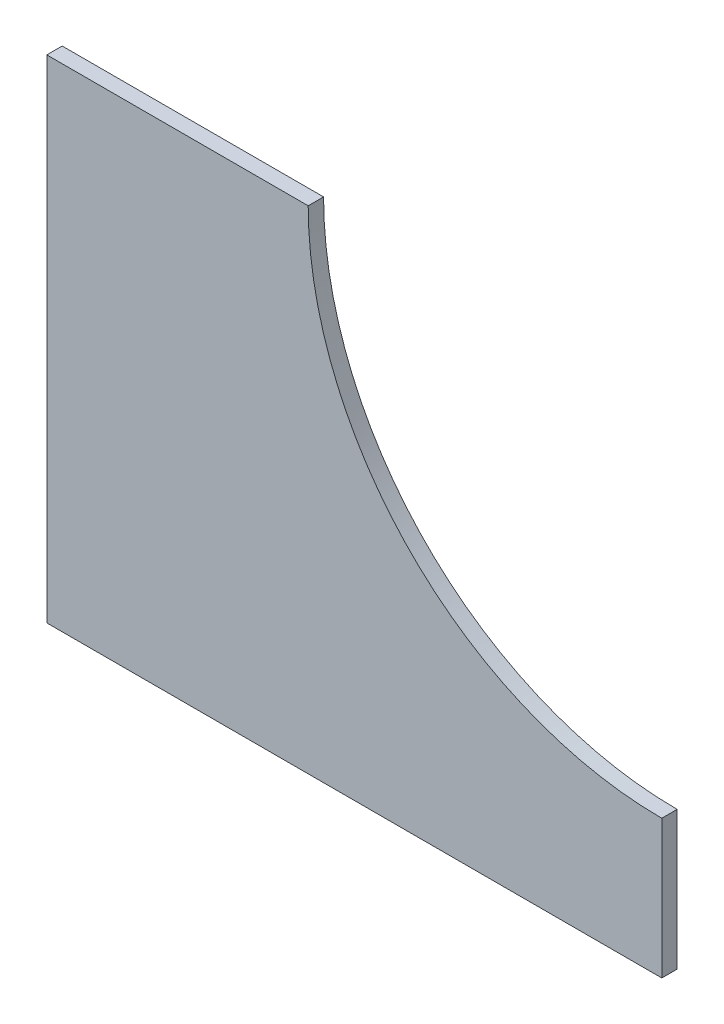
ISO-10303-21;
HEADER;
FILE_DESCRIPTION(('STEP AP214'),'2;1');
FILE_NAME('part.step','',(''),(''),'','','');
FILE_SCHEMA(('AUTOMOTIVE_DESIGN { 1 0 10303 214 1 1 1 1 }'));
ENDSEC;
DATA;
#1=APPLICATION_CONTEXT('core data for automotive mechanical design processes');
#2=APPLICATION_PROTOCOL_DEFINITION('international standard','automotive_design',2000,#1);
#3=PRODUCT_CONTEXT('',#1,'mechanical');
#4=PRODUCT('Part','Part','',(#3));
#5=PRODUCT_RELATED_PRODUCT_CATEGORY('part','',(#4));
#6=PRODUCT_DEFINITION_FORMATION('','',#4);
#7=PRODUCT_DEFINITION_CONTEXT('part definition',#1,'design');
#8=PRODUCT_DEFINITION('design','',#6,#7);
#9=PRODUCT_DEFINITION_SHAPE('','',#8);
#10=(LENGTH_UNIT() NAMED_UNIT(*) SI_UNIT(.MILLI.,.METRE.));
#11=(NAMED_UNIT(*) PLANE_ANGLE_UNIT() SI_UNIT($,.RADIAN.));
#12=(NAMED_UNIT(*) SI_UNIT($,.STERADIAN.) SOLID_ANGLE_UNIT());
#13=UNCERTAINTY_MEASURE_WITH_UNIT(LENGTH_MEASURE(1.E-05),#10,'distance_accuracy_value','');
#14=(GEOMETRIC_REPRESENTATION_CONTEXT(3) GLOBAL_UNCERTAINTY_ASSIGNED_CONTEXT((#13)) GLOBAL_UNIT_ASSIGNED_CONTEXT((#10,
#11,#12)) REPRESENTATION_CONTEXT('',''));
#15=CARTESIAN_POINT('',(0.,0.,0.));
#16=DIRECTION('',(0.,0.,1.));
#17=DIRECTION('',(1.,0.,0.));
#18=AXIS2_PLACEMENT_3D('',#15,#16,#17);
#19=CARTESIAN_POINT('',(98.4294784744164,-123.629958099048,3.175));
#20=DIRECTION('',(0.,0.,-1.));
#21=DIRECTION('',(-1.,0.,0.));
#22=AXIS2_PLACEMENT_3D('',#19,#20,#21);
#23=CYLINDRICAL_SURFACE('',#22,73.0250000000014);
#24=CARTESIAN_POINT('',(98.4294784744164,-123.629958099048,0.));
#25=DIRECTION('',(0.,0.,-1.));
#26=DIRECTION('',(-1.,0.,0.));
#27=AXIS2_PLACEMENT_3D('',#24,#25,#26);
#28=CIRCLE('',#27,73.0250000000014);
#29=CARTESIAN_POINT('',(98.4294784744164,-196.654958099049,0.));
#30=VERTEX_POINT('',#29);
#31=CARTESIAN_POINT('',(25.404478474415,-123.62995809905,0.));
#32=VERTEX_POINT('',#31);
#33=EDGE_CURVE('E109',#30,#32,#28,.T.);
#34=ORIENTED_EDGE('',*,*,#33,.T.);
#35=DIRECTION('',(0.,0.,-1.));
#36=VECTOR('',#35,1.);
#37=CARTESIAN_POINT('',(25.404478474415,-123.62995809905,3.175));
#38=LINE('',#37,#36);
#39=CARTESIAN_POINT('',(25.404478474415,-123.62995809905,3.175));
#40=VERTEX_POINT('',#39);
#41=EDGE_CURVE('E11',#40,#32,#38,.T.);
#42=ORIENTED_EDGE('',*,*,#41,.F.);
#43=CARTESIAN_POINT('',(98.4294784744164,-123.629958099048,3.175));
#44=DIRECTION('',(0.,0.,-1.));
#45=DIRECTION('',(-1.,0.,0.));
#46=AXIS2_PLACEMENT_3D('',#43,#44,#45);
#47=CIRCLE('',#46,73.0250000000014);
#48=CARTESIAN_POINT('',(98.4294784744164,-196.654958099049,3.175));
#49=VERTEX_POINT('',#48);
#50=EDGE_CURVE('E117',#49,#40,#47,.T.);
#51=ORIENTED_EDGE('',*,*,#50,.F.);
#52=DIRECTION('',(0.,0.,-1.));
#53=VECTOR('',#52,1.);
#54=CARTESIAN_POINT('',(98.4294784744164,-196.654958099049,3.175));
#55=LINE('',#54,#53);
#56=EDGE_CURVE('E105',#49,#30,#55,.T.);
#57=ORIENTED_EDGE('',*,*,#56,.T.);
#58=EDGE_LOOP('',(#34,#42,#51,#57));
#59=FACE_BOUND('',#58,.T.);
#60=ADVANCED_FACE('F35',(#59),#23,.F.);
#61=CARTESIAN_POINT('',(-28.570521525585,-123.62995809905,3.175));
#62=DIRECTION('',(0.,-1.,0.));
#63=DIRECTION('',(1.,0.,0.));
#64=AXIS2_PLACEMENT_3D('',#61,#62,#63);
#65=PLANE('',#64);
#66=DIRECTION('',(-1.,0.,0.));
#67=VECTOR('',#66,1.);
#68=CARTESIAN_POINT('',(-28.570521525585,-123.62995809905,0.));
#69=LINE('',#68,#67);
#70=CARTESIAN_POINT('',(-28.570521525585,-123.62995809905,0.));
#71=VERTEX_POINT('',#70);
#72=EDGE_CURVE('E112',#32,#71,#69,.T.);
#73=ORIENTED_EDGE('',*,*,#72,.T.);
#74=DIRECTION('',(0.,0.,-1.));
#75=VECTOR('',#74,1.);
#76=CARTESIAN_POINT('',(-28.570521525585,-123.62995809905,3.175));
#77=LINE('',#76,#75);
#78=CARTESIAN_POINT('',(-28.570521525585,-123.62995809905,3.175));
#79=VERTEX_POINT('',#78);
#80=EDGE_CURVE('E43',#79,#71,#77,.T.);
#81=ORIENTED_EDGE('',*,*,#80,.F.);
#82=DIRECTION('',(-1.,0.,0.));
#83=VECTOR('',#82,1.);
#84=CARTESIAN_POINT('',(-28.570521525585,-123.62995809905,3.175));
#85=LINE('',#84,#83);
#86=EDGE_CURVE('E85',#40,#79,#85,.T.);
#87=ORIENTED_EDGE('',*,*,#86,.F.);
#88=ORIENTED_EDGE('',*,*,#41,.T.);
#89=EDGE_LOOP('',(#73,#81,#87,#88));
#90=FACE_BOUND('',#89,.T.);
#91=ADVANCED_FACE('F136',(#90),#65,.F.);
#92=CARTESIAN_POINT('',(-28.570521525585,-225.22995809905,3.175));
#93=DIRECTION('',(1.,0.,0.));
#94=DIRECTION('',(0.,1.,0.));
#95=AXIS2_PLACEMENT_3D('',#92,#93,#94);
#96=PLANE('',#95);
#97=DIRECTION('',(0.,-1.,0.));
#98=VECTOR('',#97,1.);
#99=CARTESIAN_POINT('',(-28.570521525585,-225.22995809905,0.));
#100=LINE('',#99,#98);
#101=CARTESIAN_POINT('',(-28.570521525585,-225.22995809905,0.));
#102=VERTEX_POINT('',#101);
#103=EDGE_CURVE('E100',#71,#102,#100,.T.);
#104=ORIENTED_EDGE('',*,*,#103,.T.);
#105=DIRECTION('',(0.,0.,-1.));
#106=VECTOR('',#105,1.);
#107=CARTESIAN_POINT('',(-28.570521525585,-225.22995809905,3.175));
#108=LINE('',#107,#106);
#109=CARTESIAN_POINT('',(-28.570521525585,-225.22995809905,3.175));
#110=VERTEX_POINT('',#109);
#111=EDGE_CURVE('E97',#110,#102,#108,.T.);
#112=ORIENTED_EDGE('',*,*,#111,.F.);
#113=DIRECTION('',(0.,-1.,0.));
#114=VECTOR('',#113,1.);
#115=CARTESIAN_POINT('',(-28.570521525585,-225.22995809905,3.175));
#116=LINE('',#115,#114);
#117=EDGE_CURVE('E89',#79,#110,#116,.T.);
#118=ORIENTED_EDGE('',*,*,#117,.F.);
#119=ORIENTED_EDGE('',*,*,#80,.T.);
#120=EDGE_LOOP('',(#104,#112,#118,#119));
#121=FACE_BOUND('',#120,.T.);
#122=ADVANCED_FACE('F98',(#121),#96,.F.);
#123=CARTESIAN_POINT('',(98.4294784744164,-225.22995809905,3.175));
#124=DIRECTION('',(0.,1.,0.));
#125=DIRECTION('',(0.,0.,1.));
#126=AXIS2_PLACEMENT_3D('',#123,#124,#125);
#127=PLANE('',#126);
#128=DIRECTION('',(1.,0.,0.));
#129=VECTOR('',#128,1.);
#130=CARTESIAN_POINT('',(98.4294784744164,-225.22995809905,0.));
#131=LINE('',#130,#129);
#132=CARTESIAN_POINT('',(98.4294784744164,-225.22995809905,0.));
#133=VERTEX_POINT('',#132);
#134=EDGE_CURVE('E71',#102,#133,#131,.T.);
#135=ORIENTED_EDGE('',*,*,#134,.T.);
#136=DIRECTION('',(0.,0.,-1.));
#137=VECTOR('',#136,1.);
#138=CARTESIAN_POINT('',(98.4294784744164,-225.22995809905,3.175));
#139=LINE('',#138,#137);
#140=CARTESIAN_POINT('',(98.4294784744164,-225.22995809905,3.175));
#141=VERTEX_POINT('',#140);
#142=EDGE_CURVE('E101',#141,#133,#139,.T.);
#143=ORIENTED_EDGE('',*,*,#142,.F.);
#144=DIRECTION('',(1.,0.,0.));
#145=VECTOR('',#144,1.);
#146=CARTESIAN_POINT('',(98.4294784744164,-225.22995809905,3.175));
#147=LINE('',#146,#145);
#148=EDGE_CURVE('E93',#110,#141,#147,.T.);
#149=ORIENTED_EDGE('',*,*,#148,.F.);
#150=ORIENTED_EDGE('',*,*,#111,.T.);
#151=EDGE_LOOP('',(#135,#143,#149,#150));
#152=FACE_BOUND('',#151,.T.);
#153=ADVANCED_FACE('F103',(#152),#127,.F.);
#154=CARTESIAN_POINT('',(98.4294784744164,-196.654958099049,3.175));
#155=DIRECTION('',(-1.,0.,0.));
#156=DIRECTION('',(0.,0.,1.));
#157=AXIS2_PLACEMENT_3D('',#154,#155,#156);
#158=PLANE('',#157);
#159=DIRECTION('',(0.,1.,0.));
#160=VECTOR('',#159,1.);
#161=CARTESIAN_POINT('',(98.4294784744164,-196.654958099049,0.));
#162=LINE('',#161,#160);
#163=EDGE_CURVE('E77',#133,#30,#162,.T.);
#164=ORIENTED_EDGE('',*,*,#163,.T.);
#165=ORIENTED_EDGE('',*,*,#56,.F.);
#166=DIRECTION('',(0.,1.,0.));
#167=VECTOR('',#166,1.);
#168=CARTESIAN_POINT('',(98.4294784744164,-196.654958099049,3.175));
#169=LINE('',#168,#167);
#170=EDGE_CURVE('E51',#141,#49,#169,.T.);
#171=ORIENTED_EDGE('',*,*,#170,.F.);
#172=ORIENTED_EDGE('',*,*,#142,.T.);
#173=EDGE_LOOP('',(#164,#165,#171,#172));
#174=FACE_BOUND('',#173,.T.);
#175=ADVANCED_FACE('F125',(#174),#158,.F.);
#176=CARTESIAN_POINT('',(98.4294784744164,-123.629958099048,3.175));
#177=DIRECTION('',(0.,0.,-1.));
#178=DIRECTION('',(-1.,0.,0.));
#179=AXIS2_PLACEMENT_3D('',#176,#177,#178);
#180=PLANE('',#179);
#181=ORIENTED_EDGE('',*,*,#50,.T.);
#182=ORIENTED_EDGE('',*,*,#86,.T.);
#183=ORIENTED_EDGE('',*,*,#117,.T.);
#184=ORIENTED_EDGE('',*,*,#148,.T.);
#185=ORIENTED_EDGE('',*,*,#170,.T.);
#186=EDGE_LOOP('',(#181,#182,#183,#184,#185));
#187=FACE_BOUND('',#186,.T.);
#188=ADVANCED_FACE('F91',(#187),#180,.F.);
#189=CARTESIAN_POINT('',(98.4294784744164,-123.629958099048,0.));
#190=DIRECTION('',(0.,0.,-1.));
#191=DIRECTION('',(-1.,0.,0.));
#192=AXIS2_PLACEMENT_3D('',#189,#190,#191);
#193=PLANE('',#192);
#194=ORIENTED_EDGE('',*,*,#33,.F.);
#195=ORIENTED_EDGE('',*,*,#163,.F.);
#196=ORIENTED_EDGE('',*,*,#134,.F.);
#197=ORIENTED_EDGE('',*,*,#103,.F.);
#198=ORIENTED_EDGE('',*,*,#72,.F.);
#199=EDGE_LOOP('',(#194,#195,#196,#197,#198));
#200=FACE_BOUND('',#199,.T.);
#201=ADVANCED_FACE('F121',(#200),#193,.T.);
#202=CLOSED_SHELL('',(#60,#91,#122,#153,#175,#188,#201));
#203=MANIFOLD_SOLID_BREP('B2',#202);
#204=ADVANCED_BREP_SHAPE_REPRESENTATION('',(#18,#203),#14);
#205=SHAPE_DEFINITION_REPRESENTATION(#9,#204);
ENDSEC;
END-ISO-10303-21;
